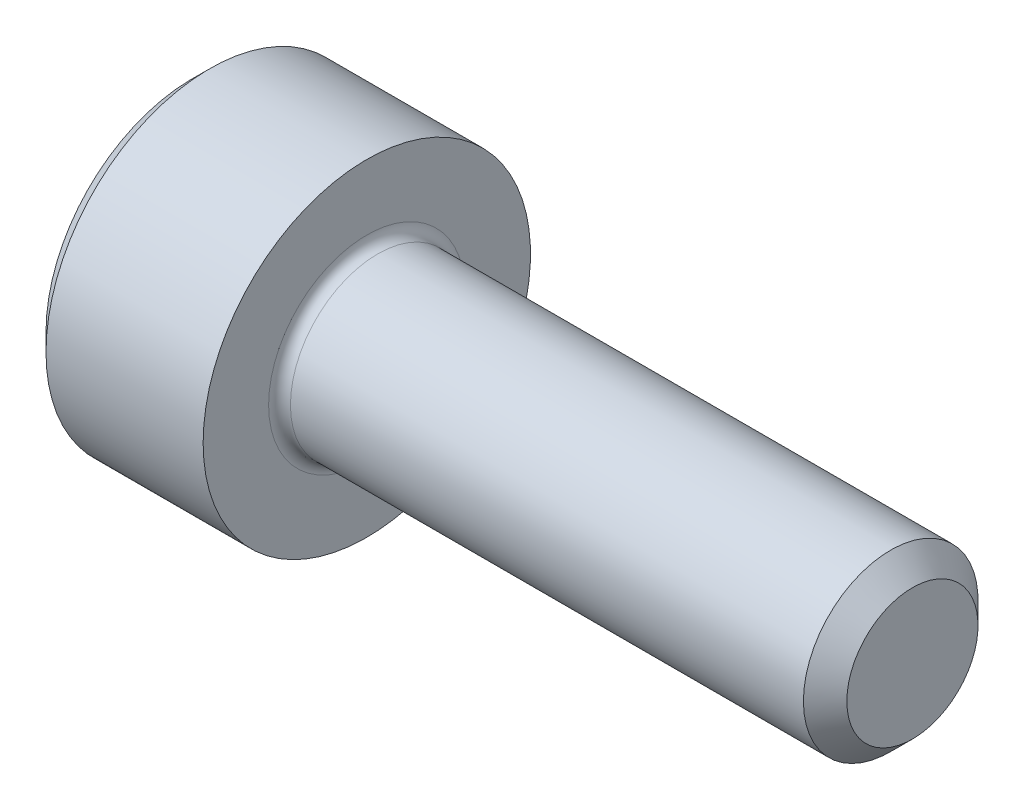
ISO-10303-21;
HEADER;
FILE_DESCRIPTION(('STEP AP214'),'2;1');
FILE_NAME('part.step','',(''),(''),'','','');
FILE_SCHEMA(('AUTOMOTIVE_DESIGN { 1 0 10303 214 1 1 1 1 }'));
ENDSEC;
DATA;
#1=APPLICATION_CONTEXT('core data for automotive mechanical design processes');
#2=APPLICATION_PROTOCOL_DEFINITION('international standard','automotive_design',2000,#1);
#3=PRODUCT_CONTEXT('',#1,'mechanical');
#4=PRODUCT('Part','Part','',(#3));
#5=PRODUCT_RELATED_PRODUCT_CATEGORY('part','',(#4));
#6=PRODUCT_DEFINITION_FORMATION('','',#4);
#7=PRODUCT_DEFINITION_CONTEXT('part definition',#1,'design');
#8=PRODUCT_DEFINITION('design','',#6,#7);
#9=PRODUCT_DEFINITION_SHAPE('','',#8);
#10=(LENGTH_UNIT() NAMED_UNIT(*) SI_UNIT(.MILLI.,.METRE.));
#11=(NAMED_UNIT(*) PLANE_ANGLE_UNIT() SI_UNIT($,.RADIAN.));
#12=(NAMED_UNIT(*) SI_UNIT($,.STERADIAN.) SOLID_ANGLE_UNIT());
#13=UNCERTAINTY_MEASURE_WITH_UNIT(LENGTH_MEASURE(1.E-05),#10,'distance_accuracy_value','');
#14=(GEOMETRIC_REPRESENTATION_CONTEXT(3) GLOBAL_UNCERTAINTY_ASSIGNED_CONTEXT((#13)) GLOBAL_UNIT_ASSIGNED_CONTEXT((#10,
#11,#12)) REPRESENTATION_CONTEXT('',''));
#15=CARTESIAN_POINT('',(0.,0.,0.));
#16=DIRECTION('',(0.,0.,1.));
#17=DIRECTION('',(1.,0.,0.));
#18=AXIS2_PLACEMENT_3D('',#15,#16,#17);
#19=CARTESIAN_POINT('',(0.,0.,0.));
#20=DIRECTION('',(-1.,0.,0.));
#21=DIRECTION('',(0.,0.,1.));
#22=AXIS2_PLACEMENT_3D('',#19,#20,#21);
#23=PLANE('',#22);
#24=DIRECTION('',(0.,-0.499999999999999,0.866025403784439));
#25=VECTOR('',#24,1.);
#26=CARTESIAN_POINT('',(0.,0.892006165897969,0.));
#27=LINE('',#26,#25);
#28=CARTESIAN_POINT('',(0.,0.892006165897969,0.));
#29=VERTEX_POINT('',#28);
#30=CARTESIAN_POINT('',(0.,0.446003082948983,0.772499999999997));
#31=VERTEX_POINT('',#30);
#32=EDGE_CURVE('E255',#29,#31,#27,.T.);
#33=ORIENTED_EDGE('',*,*,#32,.T.);
#34=DIRECTION('',(0.,1.,0.));
#35=VECTOR('',#34,1.);
#36=CARTESIAN_POINT('',(0.,-0.446003082948989,0.772499999999998));
#37=LINE('',#36,#35);
#38=CARTESIAN_POINT('',(0.,-0.446003082948989,0.772499999999998));
#39=VERTEX_POINT('',#38);
#40=EDGE_CURVE('E126',#39,#31,#37,.T.);
#41=ORIENTED_EDGE('',*,*,#40,.F.);
#42=DIRECTION('',(0.,-0.500000000000001,-0.866025403784438));
#43=VECTOR('',#42,1.);
#44=CARTESIAN_POINT('',(0.,-0.446003082948989,0.772499999999998));
#45=LINE('',#44,#43);
#46=CARTESIAN_POINT('',(0.,-0.892006165897975,0.));
#47=VERTEX_POINT('',#46);
#48=EDGE_CURVE('E258',#39,#47,#45,.T.);
#49=ORIENTED_EDGE('',*,*,#48,.T.);
#50=DIRECTION('',(0.,0.499999999999999,-0.866025403784439));
#51=VECTOR('',#50,1.);
#52=CARTESIAN_POINT('',(0.,-0.892006165897975,0.));
#53=LINE('',#52,#51);
#54=CARTESIAN_POINT('',(0.,-0.44600308294899,-0.772500000000001));
#55=VERTEX_POINT('',#54);
#56=EDGE_CURVE('E261',#47,#55,#53,.T.);
#57=ORIENTED_EDGE('',*,*,#56,.T.);
#58=DIRECTION('',(0.,-1.,0.));
#59=VECTOR('',#58,1.);
#60=CARTESIAN_POINT('',(0.,0.446003082948982,-0.772500000000003));
#61=LINE('',#60,#59);
#62=CARTESIAN_POINT('',(0.,0.446003082948982,-0.772500000000003));
#63=VERTEX_POINT('',#62);
#64=EDGE_CURVE('E264',#63,#55,#61,.T.);
#65=ORIENTED_EDGE('',*,*,#64,.F.);
#66=DIRECTION('',(0.,-0.500000000000001,-0.866025403784438));
#67=VECTOR('',#66,1.);
#68=CARTESIAN_POINT('',(0.,0.892006165897969,0.));
#69=LINE('',#68,#67);
#70=EDGE_CURVE('E121',#29,#63,#69,.T.);
#71=ORIENTED_EDGE('',*,*,#70,.F.);
#72=EDGE_LOOP('',(#33,#41,#49,#57,#65,#71));
#73=FACE_BOUND('',#72,.T.);
#74=CARTESIAN_POINT('',(0.,0.,0.));
#75=DIRECTION('',(-1.,0.,0.));
#76=DIRECTION('',(0.,0.,1.));
#77=AXIS2_PLACEMENT_3D('',#74,#75,#76);
#78=CIRCLE('',#77,1.34000000000001);
#79=CARTESIAN_POINT('',(0.,0.,1.34000000000001));
#80=VERTEX_POINT('',#79);
#81=EDGE_CURVE('E150',#80,#80,#78,.T.);
#82=ORIENTED_EDGE('',*,*,#81,.T.);
#83=EDGE_LOOP('',(#82));
#84=FACE_BOUND('',#83,.T.);
#85=ADVANCED_FACE('F30',(#73,#84),#23,.T.);
#86=CARTESIAN_POINT('',(0.,0.,0.));
#87=DIRECTION('',(1.,0.,0.));
#88=DIRECTION('',(0.,0.,-1.));
#89=AXIS2_PLACEMENT_3D('',#86,#87,#88);
#90=CONICAL_SURFACE('',#89,1.34000000000001,0.7853981633974);
#91=CARTESIAN_POINT('',(0.16,0.,0.));
#92=DIRECTION('',(-1.,0.,0.));
#93=DIRECTION('',(0.,0.,1.));
#94=AXIS2_PLACEMENT_3D('',#91,#92,#93);
#95=CIRCLE('',#94,1.5);
#96=CARTESIAN_POINT('',(0.16,0.,1.5));
#97=VERTEX_POINT('',#96);
#98=EDGE_CURVE('E147',#97,#97,#95,.T.);
#99=ORIENTED_EDGE('',*,*,#98,.T.);
#100=EDGE_LOOP('',(#99));
#101=FACE_BOUND('',#100,.T.);
#102=ORIENTED_EDGE('',*,*,#81,.F.);
#103=EDGE_LOOP('',(#102));
#104=FACE_BOUND('',#103,.T.);
#105=ADVANCED_FACE('F171',(#101,#104),#90,.T.);
#106=CARTESIAN_POINT('',(-31.75,0.,0.));
#107=DIRECTION('',(-1.,0.,0.));
#108=DIRECTION('',(0.,0.,1.));
#109=AXIS2_PLACEMENT_3D('',#106,#107,#108);
#110=CYLINDRICAL_SURFACE('',#109,1.5);
#111=CARTESIAN_POINT('',(1.6,0.,0.));
#112=DIRECTION('',(-1.,0.,0.));
#113=DIRECTION('',(0.,0.,1.));
#114=AXIS2_PLACEMENT_3D('',#111,#112,#113);
#115=CIRCLE('',#114,1.5);
#116=CARTESIAN_POINT('',(1.6,0.,1.5));
#117=VERTEX_POINT('',#116);
#118=EDGE_CURVE('E144',#117,#117,#115,.T.);
#119=ORIENTED_EDGE('',*,*,#118,.T.);
#120=EDGE_LOOP('',(#119));
#121=FACE_BOUND('',#120,.T.);
#122=ORIENTED_EDGE('',*,*,#98,.F.);
#123=EDGE_LOOP('',(#122));
#124=FACE_BOUND('',#123,.T.);
#125=ADVANCED_FACE('F176',(#121,#124),#110,.T.);
#126=CARTESIAN_POINT('',(1.6,1.5,0.));
#127=DIRECTION('',(1.,0.,0.));
#128=DIRECTION('',(0.,0.,-1.));
#129=AXIS2_PLACEMENT_3D('',#126,#127,#128);
#130=PLANE('',#129);
#131=CARTESIAN_POINT('',(1.6,0.,0.));
#132=DIRECTION('',(1.,0.,0.));
#133=DIRECTION('',(0.,0.,-1.));
#134=AXIS2_PLACEMENT_3D('',#131,#132,#133);
#135=CIRCLE('',#134,0.900000000000002);
#136=CARTESIAN_POINT('',(1.6,0.,-0.900000000000002));
#137=VERTEX_POINT('',#136);
#138=EDGE_CURVE('E38',#137,#137,#135,.F.);
#139=ORIENTED_EDGE('',*,*,#138,.T.);
#140=EDGE_LOOP('',(#139));
#141=FACE_BOUND('',#140,.T.);
#142=ORIENTED_EDGE('',*,*,#118,.F.);
#143=EDGE_LOOP('',(#142));
#144=FACE_BOUND('',#143,.T.);
#145=ADVANCED_FACE('F155',(#141,#144),#130,.T.);
#146=CARTESIAN_POINT('',(-31.75,0.,0.));
#147=DIRECTION('',(-1.,0.,0.));
#148=DIRECTION('',(0.,0.,1.));
#149=AXIS2_PLACEMENT_3D('',#146,#147,#148);
#150=CYLINDRICAL_SURFACE('',#149,0.800000000000002);
#151=CARTESIAN_POINT('',(1.7,0.,0.));
#152=DIRECTION('',(1.,0.,0.));
#153=DIRECTION('',(0.,0.,-1.));
#154=AXIS2_PLACEMENT_3D('',#151,#152,#153);
#155=CIRCLE('',#154,0.800000000000002);
#156=CARTESIAN_POINT('',(1.7,0.,-0.800000000000002));
#157=VERTEX_POINT('',#156);
#158=EDGE_CURVE('E11',#157,#157,#155,.T.);
#159=ORIENTED_EDGE('',*,*,#158,.T.);
#160=EDGE_LOOP('',(#159));
#161=FACE_BOUND('',#160,.T.);
#162=CARTESIAN_POINT('',(6.401,0.,0.));
#163=DIRECTION('',(-1.,0.,0.));
#164=DIRECTION('',(0.,0.,1.));
#165=AXIS2_PLACEMENT_3D('',#162,#163,#164);
#166=CIRCLE('',#165,0.800000000000002);
#167=CARTESIAN_POINT('',(6.401,0.,0.800000000000002));
#168=VERTEX_POINT('',#167);
#169=EDGE_CURVE('E141',#168,#168,#166,.T.);
#170=ORIENTED_EDGE('',*,*,#169,.T.);
#171=EDGE_LOOP('',(#170));
#172=FACE_BOUND('',#171,.T.);
#173=ADVANCED_FACE('F186',(#161,#172),#150,.T.);
#174=CARTESIAN_POINT('',(6.59999999999999,0.,0.));
#175=DIRECTION('',(-1.,0.,0.));
#176=DIRECTION('',(0.,0.,1.));
#177=AXIS2_PLACEMENT_3D('',#174,#175,#176);
#178=CONICAL_SURFACE('',#177,0.601000000000001,0.785398163397474);
#179=ORIENTED_EDGE('',*,*,#169,.F.);
#180=EDGE_LOOP('',(#179));
#181=FACE_BOUND('',#180,.T.);
#182=CARTESIAN_POINT('',(6.59999999999999,0.,0.));
#183=DIRECTION('',(-1.,0.,0.));
#184=DIRECTION('',(0.,0.,1.));
#185=AXIS2_PLACEMENT_3D('',#182,#183,#184);
#186=CIRCLE('',#185,0.601000000000001);
#187=CARTESIAN_POINT('',(6.59999999999999,0.,0.601000000000001));
#188=VERTEX_POINT('',#187);
#189=EDGE_CURVE('E137',#188,#188,#186,.T.);
#190=ORIENTED_EDGE('',*,*,#189,.T.);
#191=EDGE_LOOP('',(#190));
#192=FACE_BOUND('',#191,.T.);
#193=ADVANCED_FACE('F166',(#181,#192),#178,.T.);
#194=CARTESIAN_POINT('',(6.59999999999999,0.601000000000001,0.));
#195=DIRECTION('',(1.,0.,0.));
#196=DIRECTION('',(0.,0.,-1.));
#197=AXIS2_PLACEMENT_3D('',#194,#195,#196);
#198=PLANE('',#197);
#199=ORIENTED_EDGE('',*,*,#189,.F.);
#200=EDGE_LOOP('',(#199));
#201=FACE_BOUND('',#200,.T.);
#202=ADVANCED_FACE('F159',(#201),#198,.T.);
#203=CARTESIAN_POINT('',(1.7,0.,0.));
#204=DIRECTION('',(1.,0.,0.));
#205=DIRECTION('',(0.,0.,-1.));
#206=AXIS2_PLACEMENT_3D('',#203,#204,#205);
#207=TOROIDAL_SURFACE('',#206,0.900000000000002,0.1);
#208=ORIENTED_EDGE('',*,*,#158,.F.);
#209=EDGE_LOOP('',(#208));
#210=FACE_BOUND('',#209,.T.);
#211=ORIENTED_EDGE('',*,*,#138,.F.);
#212=EDGE_LOOP('',(#211));
#213=FACE_BOUND('',#212,.T.);
#214=ADVANCED_FACE('F32',(#210,#213),#207,.F.);
#215=CARTESIAN_POINT('',(0.7,0.892006165897969,0.));
#216=DIRECTION('',(0.,-0.866025403784439,-0.499999999999999));
#217=DIRECTION('',(0.,0.499999999999999,-0.866025403784439));
#218=AXIS2_PLACEMENT_3D('',#215,#216,#217);
#219=PLANE('',#218);
#220=ORIENTED_EDGE('',*,*,#32,.F.);
#221=DIRECTION('',(-1.,0.,0.));
#222=VECTOR('',#221,1.);
#223=CARTESIAN_POINT('',(0.7,0.892006165897969,0.));
#224=LINE('',#223,#222);
#225=CARTESIAN_POINT('',(0.7,0.892006165897969,0.));
#226=VERTEX_POINT('',#225);
#227=EDGE_CURVE('E245',#226,#29,#224,.T.);
#228=ORIENTED_EDGE('',*,*,#227,.F.);
#229=DIRECTION('',(0.,-0.499999999999999,0.866025403784439));
#230=VECTOR('',#229,1.);
#231=CARTESIAN_POINT('',(0.7,0.892006165897969,0.));
#232=LINE('',#231,#230);
#233=CARTESIAN_POINT('',(0.7,0.669004624423476,0.386249999999998));
#234=VERTEX_POINT('',#233);
#235=EDGE_CURVE('E113',#226,#234,#232,.T.);
#236=ORIENTED_EDGE('',*,*,#235,.T.);
#237=CARTESIAN_POINT('',(0.7,0.446003082948983,0.772499999999997));
#238=VERTEX_POINT('',#237);
#239=EDGE_CURVE('E104',#234,#238,#232,.T.);
#240=ORIENTED_EDGE('',*,*,#239,.T.);
#241=DIRECTION('',(-1.,0.,0.));
#242=VECTOR('',#241,1.);
#243=CARTESIAN_POINT('',(0.7,0.446003082948983,0.772499999999997));
#244=LINE('',#243,#242);
#245=EDGE_CURVE('E118',#238,#31,#244,.T.);
#246=ORIENTED_EDGE('',*,*,#245,.T.);
#247=EDGE_LOOP('',(#220,#228,#236,#240,#246));
#248=FACE_BOUND('',#247,.T.);
#249=ADVANCED_FACE('F117',(#248),#219,.T.);
#250=CARTESIAN_POINT('',(0.7,-0.446003082948989,0.772499999999998));
#251=DIRECTION('',(0.,0.,1.));
#252=DIRECTION('',(0.,-1.,0.));
#253=AXIS2_PLACEMENT_3D('',#250,#251,#252);
#254=PLANE('',#253);
#255=ORIENTED_EDGE('',*,*,#40,.T.);
#256=ORIENTED_EDGE('',*,*,#245,.F.);
#257=DIRECTION('',(0.,1.,0.));
#258=VECTOR('',#257,1.);
#259=CARTESIAN_POINT('',(0.7,-0.446003082948989,0.772499999999998));
#260=LINE('',#259,#258);
#261=CARTESIAN_POINT('',(0.7,0.,0.772499999999998));
#262=VERTEX_POINT('',#261);
#263=EDGE_CURVE('E101',#262,#238,#260,.T.);
#264=ORIENTED_EDGE('',*,*,#263,.F.);
#265=CARTESIAN_POINT('',(0.7,-0.446003082948989,0.772499999999998));
#266=VERTEX_POINT('',#265);
#267=EDGE_CURVE('E112',#266,#262,#260,.T.);
#268=ORIENTED_EDGE('',*,*,#267,.F.);
#269=DIRECTION('',(-1.,0.,0.));
#270=VECTOR('',#269,1.);
#271=CARTESIAN_POINT('',(0.7,-0.446003082948989,0.772499999999998));
#272=LINE('',#271,#270);
#273=EDGE_CURVE('E128',#266,#39,#272,.T.);
#274=ORIENTED_EDGE('',*,*,#273,.T.);
#275=EDGE_LOOP('',(#255,#256,#264,#268,#274));
#276=FACE_BOUND('',#275,.T.);
#277=ADVANCED_FACE('F123',(#276),#254,.F.);
#278=CARTESIAN_POINT('',(0.7,-0.446003082948989,0.772499999999998));
#279=DIRECTION('',(0.,0.866025403784438,-0.500000000000001));
#280=DIRECTION('',(0.,0.500000000000001,0.866025403784438));
#281=AXIS2_PLACEMENT_3D('',#278,#279,#280);
#282=PLANE('',#281);
#283=ORIENTED_EDGE('',*,*,#48,.F.);
#284=ORIENTED_EDGE('',*,*,#273,.F.);
#285=DIRECTION('',(0.,-0.500000000000001,-0.866025403784438));
#286=VECTOR('',#285,1.);
#287=CARTESIAN_POINT('',(0.7,-0.446003082948989,0.772499999999998));
#288=LINE('',#287,#286);
#289=CARTESIAN_POINT('',(0.7,-0.66900462442348,0.386250000000002));
#290=VERTEX_POINT('',#289);
#291=EDGE_CURVE('E284',#266,#290,#288,.T.);
#292=ORIENTED_EDGE('',*,*,#291,.T.);
#293=CARTESIAN_POINT('',(0.7,-0.892006165897975,0.));
#294=VERTEX_POINT('',#293);
#295=EDGE_CURVE('E273',#290,#294,#288,.T.);
#296=ORIENTED_EDGE('',*,*,#295,.T.);
#297=DIRECTION('',(-1.,0.,0.));
#298=VECTOR('',#297,1.);
#299=CARTESIAN_POINT('',(0.7,-0.892006165897975,0.));
#300=LINE('',#299,#298);
#301=EDGE_CURVE('E133',#294,#47,#300,.T.);
#302=ORIENTED_EDGE('',*,*,#301,.T.);
#303=EDGE_LOOP('',(#283,#284,#292,#296,#302));
#304=FACE_BOUND('',#303,.T.);
#305=ADVANCED_FACE('F199',(#304),#282,.T.);
#306=CARTESIAN_POINT('',(0.7,-0.892006165897975,0.));
#307=DIRECTION('',(0.,0.866025403784439,0.499999999999999));
#308=DIRECTION('',(0.,-0.5,0.866025403784439));
#309=AXIS2_PLACEMENT_3D('',#306,#307,#308);
#310=PLANE('',#309);
#311=ORIENTED_EDGE('',*,*,#56,.F.);
#312=ORIENTED_EDGE('',*,*,#301,.F.);
#313=DIRECTION('',(0.,0.499999999999999,-0.866025403784439));
#314=VECTOR('',#313,1.);
#315=CARTESIAN_POINT('',(0.7,-0.892006165897975,0.));
#316=LINE('',#315,#314);
#317=CARTESIAN_POINT('',(0.7,-0.669004624423482,-0.386250000000001));
#318=VERTEX_POINT('',#317);
#319=EDGE_CURVE('E251',#294,#318,#316,.T.);
#320=ORIENTED_EDGE('',*,*,#319,.T.);
#321=CARTESIAN_POINT('',(0.7,-0.44600308294899,-0.772500000000001));
#322=VERTEX_POINT('',#321);
#323=EDGE_CURVE('E283',#318,#322,#316,.T.);
#324=ORIENTED_EDGE('',*,*,#323,.T.);
#325=DIRECTION('',(-1.,0.,0.));
#326=VECTOR('',#325,1.);
#327=CARTESIAN_POINT('',(0.7,-0.44600308294899,-0.772500000000001));
#328=LINE('',#327,#326);
#329=EDGE_CURVE('E244',#322,#55,#328,.T.);
#330=ORIENTED_EDGE('',*,*,#329,.T.);
#331=EDGE_LOOP('',(#311,#312,#320,#324,#330));
#332=FACE_BOUND('',#331,.T.);
#333=ADVANCED_FACE('F202',(#332),#310,.T.);
#334=CARTESIAN_POINT('',(0.7,0.446003082948982,-0.772500000000003));
#335=DIRECTION('',(0.,0.,-1.));
#336=DIRECTION('',(0.,1.,0.));
#337=AXIS2_PLACEMENT_3D('',#334,#335,#336);
#338=PLANE('',#337);
#339=ORIENTED_EDGE('',*,*,#64,.T.);
#340=ORIENTED_EDGE('',*,*,#329,.F.);
#341=DIRECTION('',(0.,-1.,0.));
#342=VECTOR('',#341,1.);
#343=CARTESIAN_POINT('',(0.7,0.446003082948982,-0.772500000000003));
#344=LINE('',#343,#342);
#345=CARTESIAN_POINT('',(0.700000000000004,0.,-0.772500000000001));
#346=VERTEX_POINT('',#345);
#347=EDGE_CURVE('E248',#346,#322,#344,.T.);
#348=ORIENTED_EDGE('',*,*,#347,.F.);
#349=CARTESIAN_POINT('',(0.7,0.446003082948982,-0.772500000000003));
#350=VERTEX_POINT('',#349);
#351=EDGE_CURVE('E45',#350,#346,#344,.T.);
#352=ORIENTED_EDGE('',*,*,#351,.F.);
#353=DIRECTION('',(-1.,0.,0.));
#354=VECTOR('',#353,1.);
#355=CARTESIAN_POINT('',(0.7,0.446003082948982,-0.772500000000003));
#356=LINE('',#355,#354);
#357=EDGE_CURVE('E241',#350,#63,#356,.T.);
#358=ORIENTED_EDGE('',*,*,#357,.T.);
#359=EDGE_LOOP('',(#339,#340,#348,#352,#358));
#360=FACE_BOUND('',#359,.T.);
#361=ADVANCED_FACE('F206',(#360),#338,.F.);
#362=CARTESIAN_POINT('',(0.7,0.892006165897969,0.));
#363=DIRECTION('',(0.,0.866025403784438,-0.500000000000001));
#364=DIRECTION('',(0.,0.500000000000001,0.866025403784438));
#365=AXIS2_PLACEMENT_3D('',#362,#363,#364);
#366=PLANE('',#365);
#367=ORIENTED_EDGE('',*,*,#70,.T.);
#368=ORIENTED_EDGE('',*,*,#357,.F.);
#369=DIRECTION('',(0.,-0.500000000000001,-0.866025403784438));
#370=VECTOR('',#369,1.);
#371=CARTESIAN_POINT('',(0.7,0.892006165897969,0.));
#372=LINE('',#371,#370);
#373=CARTESIAN_POINT('',(0.7,0.669004624423477,-0.38625));
#374=VERTEX_POINT('',#373);
#375=EDGE_CURVE('E231',#374,#350,#372,.T.);
#376=ORIENTED_EDGE('',*,*,#375,.F.);
#377=EDGE_CURVE('E237',#226,#374,#372,.T.);
#378=ORIENTED_EDGE('',*,*,#377,.F.);
#379=ORIENTED_EDGE('',*,*,#227,.T.);
#380=EDGE_LOOP('',(#367,#368,#376,#378,#379));
#381=FACE_BOUND('',#380,.T.);
#382=ADVANCED_FACE('F210',(#381),#366,.F.);
#383=CARTESIAN_POINT('',(0.7,0.,1.545));
#384=DIRECTION('',(1.,0.,0.));
#385=DIRECTION('',(0.,0.,-1.));
#386=AXIS2_PLACEMENT_3D('',#383,#384,#385);
#387=PLANE('',#386);
#388=ORIENTED_EDGE('',*,*,#347,.T.);
#389=ORIENTED_EDGE('',*,*,#323,.F.);
#390=CARTESIAN_POINT('',(0.700000000000004,0.,0.));
#391=DIRECTION('',(-1.,0.,0.));
#392=DIRECTION('',(0.,0.,1.));
#393=AXIS2_PLACEMENT_3D('',#390,#391,#392);
#394=CIRCLE('',#393,0.772500000000001);
#395=EDGE_CURVE('E279',#346,#318,#394,.T.);
#396=ORIENTED_EDGE('',*,*,#395,.F.);
#397=EDGE_LOOP('',(#388,#389,#396));
#398=FACE_BOUND('',#397,.T.);
#399=ADVANCED_FACE('F214',(#398),#387,.F.);
#400=ORIENTED_EDGE('',*,*,#319,.F.);
#401=ORIENTED_EDGE('',*,*,#295,.F.);
#402=EDGE_CURVE('E131',#318,#290,#394,.T.);
#403=ORIENTED_EDGE('',*,*,#402,.F.);
#404=EDGE_LOOP('',(#400,#401,#403));
#405=FACE_BOUND('',#404,.T.);
#406=ADVANCED_FACE('F217',(#405),#387,.F.);
#407=ORIENTED_EDGE('',*,*,#291,.F.);
#408=ORIENTED_EDGE('',*,*,#267,.T.);
#409=EDGE_CURVE('E127',#290,#262,#394,.T.);
#410=ORIENTED_EDGE('',*,*,#409,.F.);
#411=EDGE_LOOP('',(#407,#408,#410));
#412=FACE_BOUND('',#411,.T.);
#413=ADVANCED_FACE('F222',(#412),#387,.F.);
#414=ORIENTED_EDGE('',*,*,#263,.T.);
#415=ORIENTED_EDGE('',*,*,#239,.F.);
#416=EDGE_CURVE('E107',#262,#234,#394,.T.);
#417=ORIENTED_EDGE('',*,*,#416,.F.);
#418=EDGE_LOOP('',(#414,#415,#417));
#419=FACE_BOUND('',#418,.T.);
#420=ADVANCED_FACE('F103',(#419),#387,.F.);
#421=ORIENTED_EDGE('',*,*,#235,.F.);
#422=ORIENTED_EDGE('',*,*,#377,.T.);
#423=EDGE_CURVE('E138',#234,#374,#394,.T.);
#424=ORIENTED_EDGE('',*,*,#423,.F.);
#425=EDGE_LOOP('',(#421,#422,#424));
#426=FACE_BOUND('',#425,.T.);
#427=ADVANCED_FACE('F225',(#426),#387,.F.);
#428=ORIENTED_EDGE('',*,*,#375,.T.);
#429=ORIENTED_EDGE('',*,*,#351,.T.);
#430=EDGE_CURVE('E234',#374,#346,#394,.T.);
#431=ORIENTED_EDGE('',*,*,#430,.F.);
#432=EDGE_LOOP('',(#428,#429,#431));
#433=FACE_BOUND('',#432,.T.);
#434=ADVANCED_FACE('F195',(#433),#387,.F.);
#435=CARTESIAN_POINT('',(0.700000000000004,0.,0.));
#436=DIRECTION('',(-1.,0.,0.));
#437=DIRECTION('',(0.,0.,1.));
#438=AXIS2_PLACEMENT_3D('',#435,#436,#437);
#439=CONICAL_SURFACE('',#438,0.772500000000001,1.04719755119659);
#440=CARTESIAN_POINT('',(1.146003082949,0.,0.));
#441=VERTEX_POINT('',#440);
#442=VERTEX_LOOP('',#441);
#443=FACE_BOUND('',#442,.T.);
#444=ORIENTED_EDGE('',*,*,#416,.T.);
#445=ORIENTED_EDGE('',*,*,#423,.T.);
#446=ORIENTED_EDGE('',*,*,#430,.T.);
#447=ORIENTED_EDGE('',*,*,#395,.T.);
#448=ORIENTED_EDGE('',*,*,#402,.T.);
#449=ORIENTED_EDGE('',*,*,#409,.T.);
#450=EDGE_LOOP('',(#444,#445,#446,#447,#448,#449));
#451=FACE_BOUND('',#450,.T.);
#452=ADVANCED_FACE('F193',(#443,#451),#439,.F.);
#453=CLOSED_SHELL('',(#85,#105,#125,#145,#173,#193,#202,#214,#249,#277,#305,#333,#361,#382,#399,
#406,#413,#420,#427,#434,#452));
#454=MANIFOLD_SOLID_BREP('B2',#453);
#455=ADVANCED_BREP_SHAPE_REPRESENTATION('',(#18,#454),#14);
#456=SHAPE_DEFINITION_REPRESENTATION(#9,#455);
ENDSEC;
END-ISO-10303-21;
